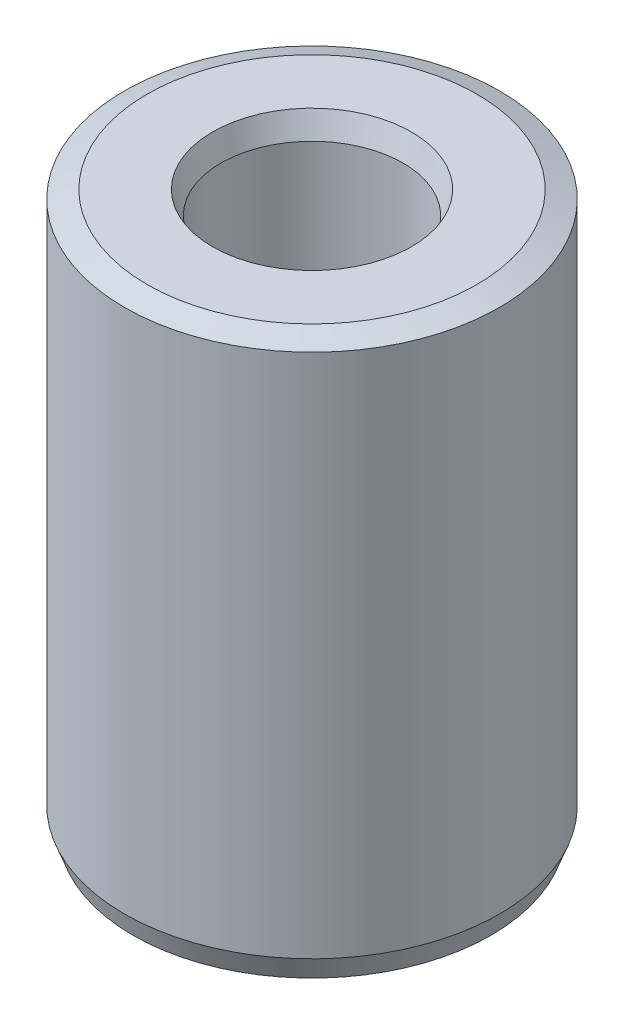
ISO-10303-21;
HEADER;
FILE_DESCRIPTION(('STEP AP214'),'2;1');
FILE_NAME('part.step','',(''),(''),'','','');
FILE_SCHEMA(('AUTOMOTIVE_DESIGN { 1 0 10303 214 1 1 1 1 }'));
ENDSEC;
DATA;
#1=APPLICATION_CONTEXT('core data for automotive mechanical design processes');
#2=APPLICATION_PROTOCOL_DEFINITION('international standard','automotive_design',2000,#1);
#3=PRODUCT_CONTEXT('',#1,'mechanical');
#4=PRODUCT('Part','Part','',(#3));
#5=PRODUCT_RELATED_PRODUCT_CATEGORY('part','',(#4));
#6=PRODUCT_DEFINITION_FORMATION('','',#4);
#7=PRODUCT_DEFINITION_CONTEXT('part definition',#1,'design');
#8=PRODUCT_DEFINITION('design','',#6,#7);
#9=PRODUCT_DEFINITION_SHAPE('','',#8);
#10=(LENGTH_UNIT() NAMED_UNIT(*) SI_UNIT(.MILLI.,.METRE.));
#11=(NAMED_UNIT(*) PLANE_ANGLE_UNIT() SI_UNIT($,.RADIAN.));
#12=(NAMED_UNIT(*) SI_UNIT($,.STERADIAN.) SOLID_ANGLE_UNIT());
#13=UNCERTAINTY_MEASURE_WITH_UNIT(LENGTH_MEASURE(1.E-05),#10,'distance_accuracy_value','');
#14=(GEOMETRIC_REPRESENTATION_CONTEXT(3) GLOBAL_UNCERTAINTY_ASSIGNED_CONTEXT((#13)) GLOBAL_UNIT_ASSIGNED_CONTEXT((#10,
#11,#12)) REPRESENTATION_CONTEXT('',''));
#15=CARTESIAN_POINT('',(0.,0.,0.));
#16=DIRECTION('',(0.,0.,1.));
#17=DIRECTION('',(1.,0.,0.));
#18=AXIS2_PLACEMENT_3D('',#15,#16,#17);
#19=CARTESIAN_POINT('',(0.,148.334228353664,0.));
#20=DIRECTION('',(0.,-1.,0.));
#21=DIRECTION('',(0.,0.,-1.));
#22=AXIS2_PLACEMENT_3D('',#19,#20,#21);
#23=CYLINDRICAL_SURFACE('',#22,50.);
#24=CARTESIAN_POINT('',(0.,6.04557478927847,0.));
#25=DIRECTION('',(0.,1.,0.));
#26=DIRECTION('',(0.,0.,1.));
#27=AXIS2_PLACEMENT_3D('',#24,#25,#26);
#28=CIRCLE('',#27,50.);
#29=CARTESIAN_POINT('',(0.,6.04557478927847,50.));
#30=VERTEX_POINT('',#29);
#31=EDGE_CURVE('E10',#30,#30,#28,.T.);
#32=ORIENTED_EDGE('',*,*,#31,.T.);
#33=EDGE_LOOP('',(#32));
#34=FACE_BOUND('',#33,.T.);
#35=CARTESIAN_POINT('',(0.,146.077051592879,0.));
#36=DIRECTION('',(0.,1.,0.));
#37=DIRECTION('',(0.,0.,1.));
#38=AXIS2_PLACEMENT_3D('',#35,#36,#37);
#39=CIRCLE('',#38,50.);
#40=CARTESIAN_POINT('',(0.,146.077051592879,50.));
#41=VERTEX_POINT('',#40);
#42=EDGE_CURVE('E50',#41,#41,#39,.F.);
#43=ORIENTED_EDGE('',*,*,#42,.T.);
#44=EDGE_LOOP('',(#43));
#45=FACE_BOUND('',#44,.T.);
#46=ADVANCED_FACE('F39',(#34,#45),#23,.T.);
#47=CARTESIAN_POINT('',(0.,148.334228353664,0.));
#48=DIRECTION('',(0.,1.,0.));
#49=DIRECTION('',(0.,0.,1.));
#50=AXIS2_PLACEMENT_3D('',#47,#48,#49);
#51=PLANE('',#50);
#52=CARTESIAN_POINT('',(0.,148.334228353664,0.));
#53=DIRECTION('',(0.,1.,0.));
#54=DIRECTION('',(0.,0.,1.));
#55=AXIS2_PLACEMENT_3D('',#52,#53,#54);
#56=CIRCLE('',#55,26.5149388188066);
#57=CARTESIAN_POINT('',(0.,148.334228353664,26.5149388188066));
#58=VERTEX_POINT('',#57);
#59=EDGE_CURVE('E58',#58,#58,#56,.F.);
#60=ORIENTED_EDGE('',*,*,#59,.T.);
#61=EDGE_LOOP('',(#60));
#62=FACE_BOUND('',#61,.T.);
#63=CARTESIAN_POINT('',(0.,148.334228353664,0.));
#64=DIRECTION('',(0.,1.,0.));
#65=DIRECTION('',(0.,0.,1.));
#66=AXIS2_PLACEMENT_3D('',#63,#64,#65);
#67=CIRCLE('',#66,43.9544252107214);
#68=CARTESIAN_POINT('',(0.,148.334228353664,43.9544252107214));
#69=VERTEX_POINT('',#68);
#70=EDGE_CURVE('E61',#69,#69,#67,.T.);
#71=ORIENTED_EDGE('',*,*,#70,.T.);
#72=EDGE_LOOP('',(#71));
#73=FACE_BOUND('',#72,.T.);
#74=ADVANCED_FACE('F88',(#62,#73),#51,.T.);
#75=CARTESIAN_POINT('',(0.,0.,0.));
#76=DIRECTION('',(0.,1.,0.));
#77=DIRECTION('',(0.,0.,1.));
#78=AXIS2_PLACEMENT_3D('',#75,#76,#77);
#79=PLANE('',#78);
#80=CARTESIAN_POINT('',(0.,0.,0.));
#81=DIRECTION('',(0.,1.,0.));
#82=DIRECTION('',(0.,0.,1.));
#83=AXIS2_PLACEMENT_3D('',#80,#81,#82);
#84=CIRCLE('',#83,30.3033368473009);
#85=CARTESIAN_POINT('',(0.,0.,30.3033368473009));
#86=VERTEX_POINT('',#85);
#87=EDGE_CURVE('E51',#86,#86,#84,.T.);
#88=ORIENTED_EDGE('',*,*,#87,.T.);
#89=EDGE_LOOP('',(#88));
#90=FACE_BOUND('',#89,.T.);
#91=CARTESIAN_POINT('',(0.,0.,0.));
#92=DIRECTION('',(0.,1.,0.));
#93=DIRECTION('',(0.,0.,1.));
#94=AXIS2_PLACEMENT_3D('',#91,#92,#93);
#95=CIRCLE('',#94,47.7428232392157);
#96=CARTESIAN_POINT('',(0.,0.,47.7428232392157));
#97=VERTEX_POINT('',#96);
#98=EDGE_CURVE('E54',#97,#97,#95,.F.);
#99=ORIENTED_EDGE('',*,*,#98,.T.);
#100=EDGE_LOOP('',(#99));
#101=FACE_BOUND('',#100,.T.);
#102=ADVANCED_FACE('F83',(#90,#101),#79,.F.);
#103=CARTESIAN_POINT('',(0.,148.334228353664,0.));
#104=DIRECTION('',(0.,-1.,0.));
#105=DIRECTION('',(0.,0.,-1.));
#106=AXIS2_PLACEMENT_3D('',#103,#104,#105);
#107=CYLINDRICAL_SURFACE('',#106,24.2577620580223);
#108=CARTESIAN_POINT('',(0.,142.288653564385,0.));
#109=DIRECTION('',(0.,1.,0.));
#110=DIRECTION('',(0.,0.,1.));
#111=AXIS2_PLACEMENT_3D('',#108,#109,#110);
#112=CIRCLE('',#111,24.2577620580223);
#113=CARTESIAN_POINT('',(0.,142.288653564385,24.2577620580223));
#114=VERTEX_POINT('',#113);
#115=EDGE_CURVE('E67',#114,#114,#112,.T.);
#116=ORIENTED_EDGE('',*,*,#115,.T.);
#117=EDGE_LOOP('',(#116));
#118=FACE_BOUND('',#117,.T.);
#119=CARTESIAN_POINT('',(0.,2.25717676078435,0.));
#120=DIRECTION('',(0.,1.,0.));
#121=DIRECTION('',(0.,0.,1.));
#122=AXIS2_PLACEMENT_3D('',#119,#120,#121);
#123=CIRCLE('',#122,24.2577620580223);
#124=CARTESIAN_POINT('',(0.,2.25717676078435,24.2577620580223));
#125=VERTEX_POINT('',#124);
#126=EDGE_CURVE('E69',#125,#125,#123,.F.);
#127=ORIENTED_EDGE('',*,*,#126,.T.);
#128=EDGE_LOOP('',(#127));
#129=FACE_BOUND('',#128,.T.);
#130=ADVANCED_FACE('F71',(#118,#129),#107,.F.);
#131=CARTESIAN_POINT('',(0.,142.288653564385,0.));
#132=DIRECTION('',(0.,1.,0.));
#133=DIRECTION('',(0.,0.,1.));
#134=AXIS2_PLACEMENT_3D('',#131,#132,#133);
#135=CONICAL_SURFACE('',#134,24.2577620580223,0.357332226388512);
#136=CARTESIAN_POINT('',(0.,148.334228353664,26.5149388188066));
#137=CARTESIAN_POINT('',(0.,148.271253616275,26.4914265608818));
#138=CARTESIAN_POINT('',(0.,148.208278878887,26.467914302957));
#139=CARTESIAN_POINT('',(0.,148.082329404111,26.4208897871073));
#140=CARTESIAN_POINT('',(0.,148.019354666722,26.3973775291825));
#141=CARTESIAN_POINT('',(0.,147.893405191946,26.3503530133328));
#142=CARTESIAN_POINT('',(0.,147.830430454557,26.3268407554079));
#143=CARTESIAN_POINT('',(0.,147.704480979781,26.2798162395583));
#144=CARTESIAN_POINT('',(0.,147.641506242392,26.2563039816334));
#145=CARTESIAN_POINT('',(0.,147.515556767616,26.2092794657838));
#146=CARTESIAN_POINT('',(0.,147.452582030227,26.1857672078589));
#147=CARTESIAN_POINT('',(0.,147.326632555451,26.1387426920092));
#148=CARTESIAN_POINT('',(0.,147.263657818062,26.1152304340844));
#149=CARTESIAN_POINT('',(0.,147.137708343286,26.0682059182347));
#150=CARTESIAN_POINT('',(0.,147.074733605897,26.0446936603099));
#151=CARTESIAN_POINT('',(0.,146.948784131121,25.9976691444602));
#152=CARTESIAN_POINT('',(0.,146.885809393732,25.9741568865354));
#153=CARTESIAN_POINT('',(0.,146.759859918956,25.9271323706857));
#154=CARTESIAN_POINT('',(0.,146.696885181567,25.9036201127609));
#155=CARTESIAN_POINT('',(0.,146.570935706791,25.8565955969112));
#156=CARTESIAN_POINT('',(0.,146.507960969402,25.8330833389864));
#157=CARTESIAN_POINT('',(0.,146.382011494626,25.7860588231367));
#158=CARTESIAN_POINT('',(0.,146.319036757238,25.7625465652119));
#159=CARTESIAN_POINT('',(0.,146.193087282461,25.7155220493622));
#160=CARTESIAN_POINT('',(0.,146.130112545073,25.6920097914373));
#161=CARTESIAN_POINT('',(0.,146.004163070296,25.6449852755877));
#162=CARTESIAN_POINT('',(0.,145.941188332908,25.6214730176628));
#163=CARTESIAN_POINT('',(0.,145.815238858131,25.5744485018132));
#164=CARTESIAN_POINT('',(0.,145.752264120743,25.5509362438883));
#165=CARTESIAN_POINT('',(0.,145.626314645966,25.5039117280386));
#166=CARTESIAN_POINT('',(0.,145.563339908578,25.4803994701138));
#167=CARTESIAN_POINT('',(0.,145.437390433801,25.4333749542641));
#168=CARTESIAN_POINT('',(0.,145.374415696413,25.4098626963393));
#169=CARTESIAN_POINT('',(0.,145.248466221636,25.3628381804896));
#170=CARTESIAN_POINT('',(0.,145.185491484248,25.3393259225648));
#171=CARTESIAN_POINT('',(0.,145.059542009471,25.2923014067151));
#172=CARTESIAN_POINT('',(0.,144.996567272083,25.2687891487903));
#173=CARTESIAN_POINT('',(0.,144.870617797306,25.2217646329406));
#174=CARTESIAN_POINT('',(0.,144.807643059918,25.1982523750158));
#175=CARTESIAN_POINT('',(0.,144.681693585141,25.1512278591661));
#176=CARTESIAN_POINT('',(0.,144.618718847753,25.1277156012413));
#177=CARTESIAN_POINT('',(0.,144.492769372976,25.0806910853916));
#178=CARTESIAN_POINT('',(0.,144.429794635588,25.0571788274667));
#179=CARTESIAN_POINT('',(0.,144.303845160811,25.0101543116171));
#180=CARTESIAN_POINT('',(0.,144.240870423423,24.9866420536922));
#181=CARTESIAN_POINT('',(0.,144.114920948646,24.9396175378426));
#182=CARTESIAN_POINT('',(0.,144.051946211258,24.9161052799177));
#183=CARTESIAN_POINT('',(0.,143.925996736481,24.869080764068));
#184=CARTESIAN_POINT('',(0.,143.863021999093,24.8455685061432));
#185=CARTESIAN_POINT('',(0.,143.737072524316,24.7985439902935));
#186=CARTESIAN_POINT('',(0.,143.674097786928,24.7750317323687));
#187=CARTESIAN_POINT('',(0.,143.548148312152,24.728007216519));
#188=CARTESIAN_POINT('',(0.,143.485173574763,24.7044949585942));
#189=CARTESIAN_POINT('',(0.,143.359224099987,24.6574704427445));
#190=CARTESIAN_POINT('',(0.,143.296249362598,24.6339581848197));
#191=CARTESIAN_POINT('',(0.,143.170299887822,24.58693366897));
#192=CARTESIAN_POINT('',(0.,143.107325150433,24.5634214110452));
#193=CARTESIAN_POINT('',(0.,142.981375675657,24.5163968951955));
#194=CARTESIAN_POINT('',(0.,142.918400938268,24.4928846372707));
#195=CARTESIAN_POINT('',(0.,142.792451463492,24.445860121421));
#196=CARTESIAN_POINT('',(0.,142.729476726103,24.4223478634961));
#197=CARTESIAN_POINT('',(0.,142.603527251327,24.3753233476465));
#198=CARTESIAN_POINT('',(0.,142.540552513938,24.3518110897216));
#199=CARTESIAN_POINT('',(0.,142.414603039162,24.304786573872));
#200=CARTESIAN_POINT('',(0.,142.351628301773,24.2812743159471));
#201=CARTESIAN_POINT('',(0.,142.288653564385,24.2577620580223));
#202=B_SPLINE_CURVE_WITH_KNOTS('',3,(#136,#137,#138,#139,#140,#141,#142,#143,#144,#145,#146,
#147,#148,#149,#150,#151,#152,#153,#154,#155,#156,#157,#158,#159,#160,#161,#162,#163,#164,#165,
#166,#167,#168,#169,#170,#171,#172,#173,#174,#175,#176,#177,#178,#179,#180,#181,#182,#183,#184,
#185,#186,#187,#188,#189,#190,#191,#192,#193,#194,#195,#196,#197,#198,#199,#200,#201),
.UNSPECIFIED.,.F.,.F.,(4,2,2,2,2,2,2,2,2,2,2,2,2,2,2,2,2,2,2,2,2,2,2,2,2,2,2,2,2,2,2,2,4),(0.,
0.201662575597598,0.403325151195222,0.604987726792844,0.806650302390468,1.00831287798809,
1.20997545358571,1.41163802918334,1.61330060478096,1.81496318037858,2.01662575597621,
2.21828833157383,2.41995090717145,2.62161348276908,2.8232760583667,3.02493863396432,
3.22660120956195,3.42826378515954,3.62992636075717,3.83158893635479,4.03325151195241,
4.23491408755004,4.43657666314766,4.63823923874528,4.8399018143429,5.04156438994053,
5.24322696553815,5.44488954113577,5.6465521167334,5.84821469233102,6.04987726792864,
6.25153984352627,6.45320241912386),.UNSPECIFIED.);
#203=EDGE_CURVE('BSEAM77',#58,#114,#202,.T.);
#204=ORIENTED_EDGE('',*,*,#59,.F.);
#205=ORIENTED_EDGE('',*,*,#115,.F.);
#206=ORIENTED_EDGE('',*,*,#203,.T.);
#207=ORIENTED_EDGE('',*,*,#203,.F.);
#208=EDGE_LOOP('',(#204,#206,#205,#207));
#209=FACE_BOUND('',#208,.T.);
#210=ADVANCED_FACE('F77',(#209),#135,.F.);
#211=CARTESIAN_POINT('',(0.,0.,0.));
#212=DIRECTION('',(0.,-1.,0.));
#213=DIRECTION('',(0.,0.,-1.));
#214=AXIS2_PLACEMENT_3D('',#211,#212,#213);
#215=CONICAL_SURFACE('',#214,30.3033368473009,1.21346410040638);
#216=ORIENTED_EDGE('',*,*,#126,.F.);
#217=EDGE_LOOP('',(#216));
#218=FACE_BOUND('',#217,.T.);
#219=ORIENTED_EDGE('',*,*,#87,.F.);
#220=EDGE_LOOP('',(#219));
#221=FACE_BOUND('',#220,.T.);
#222=ADVANCED_FACE('F73',(#218,#221),#215,.F.);
#223=CARTESIAN_POINT('',(0.,6.04557478927847,0.));
#224=DIRECTION('',(0.,1.,0.));
#225=DIRECTION('',(0.,0.,1.));
#226=AXIS2_PLACEMENT_3D('',#223,#224,#225);
#227=CONICAL_SURFACE('',#226,50.,0.357332226388514);
#228=ORIENTED_EDGE('',*,*,#98,.F.);
#229=EDGE_LOOP('',(#228));
#230=FACE_BOUND('',#229,.T.);
#231=ORIENTED_EDGE('',*,*,#31,.F.);
#232=EDGE_LOOP('',(#231));
#233=FACE_BOUND('',#232,.T.);
#234=ADVANCED_FACE('F76',(#230,#233),#227,.T.);
#235=CARTESIAN_POINT('',(0.,148.334228353664,0.));
#236=DIRECTION('',(0.,-1.,0.));
#237=DIRECTION('',(0.,0.,-1.));
#238=AXIS2_PLACEMENT_3D('',#235,#236,#237);
#239=CONICAL_SURFACE('',#238,43.9544252107214,1.21346410040638);
#240=ORIENTED_EDGE('',*,*,#42,.F.);
#241=EDGE_LOOP('',(#240));
#242=FACE_BOUND('',#241,.T.);
#243=ORIENTED_EDGE('',*,*,#70,.F.);
#244=EDGE_LOOP('',(#243));
#245=FACE_BOUND('',#244,.T.);
#246=ADVANCED_FACE('F45',(#242,#245),#239,.T.);
#247=CLOSED_SHELL('',(#46,#74,#102,#130,#210,#222,#234,#246));
#248=MANIFOLD_SOLID_BREP('B2',#247);
#249=ADVANCED_BREP_SHAPE_REPRESENTATION('',(#18,#248),#14);
#250=SHAPE_DEFINITION_REPRESENTATION(#9,#249);
ENDSEC;
END-ISO-10303-21;
